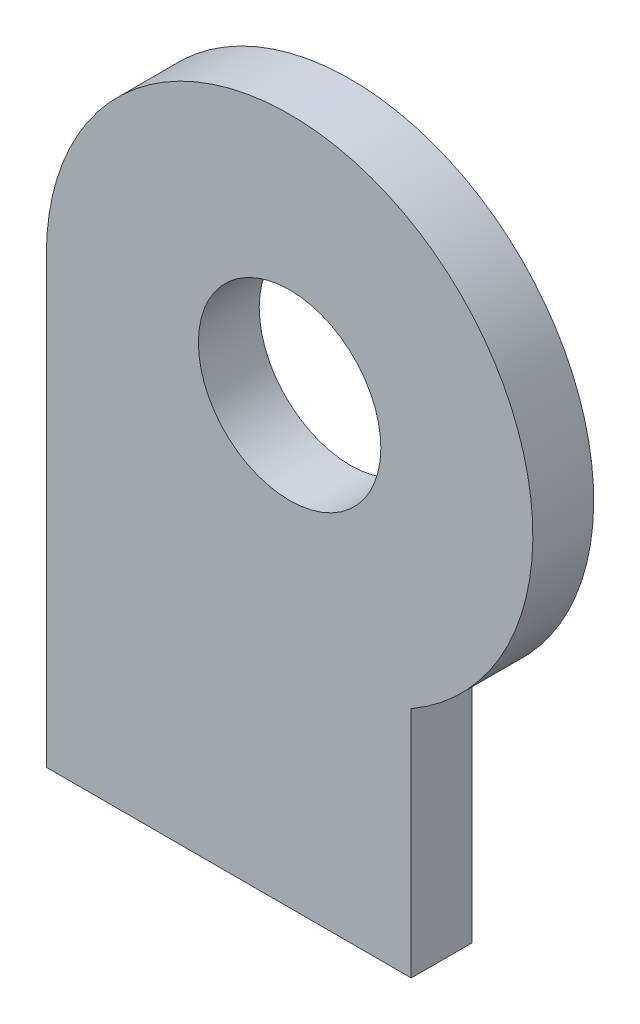
ISO-10303-21;
HEADER;
FILE_DESCRIPTION(('STEP AP214'),'2;1');
FILE_NAME('part.step','',(''),(''),'','','');
FILE_SCHEMA(('AUTOMOTIVE_DESIGN { 1 0 10303 214 1 1 1 1 }'));
ENDSEC;
DATA;
#1=APPLICATION_CONTEXT('core data for automotive mechanical design processes');
#2=APPLICATION_PROTOCOL_DEFINITION('international standard','automotive_design',2000,#1);
#3=PRODUCT_CONTEXT('',#1,'mechanical');
#4=PRODUCT('Part','Part','',(#3));
#5=PRODUCT_RELATED_PRODUCT_CATEGORY('part','',(#4));
#6=PRODUCT_DEFINITION_FORMATION('','',#4);
#7=PRODUCT_DEFINITION_CONTEXT('part definition',#1,'design');
#8=PRODUCT_DEFINITION('design','',#6,#7);
#9=PRODUCT_DEFINITION_SHAPE('','',#8);
#10=(LENGTH_UNIT() NAMED_UNIT(*) SI_UNIT(.MILLI.,.METRE.));
#11=(NAMED_UNIT(*) PLANE_ANGLE_UNIT() SI_UNIT($,.RADIAN.));
#12=(NAMED_UNIT(*) SI_UNIT($,.STERADIAN.) SOLID_ANGLE_UNIT());
#13=UNCERTAINTY_MEASURE_WITH_UNIT(LENGTH_MEASURE(1.E-05),#10,'distance_accuracy_value','');
#14=(GEOMETRIC_REPRESENTATION_CONTEXT(3) GLOBAL_UNCERTAINTY_ASSIGNED_CONTEXT((#13)) GLOBAL_UNIT_ASSIGNED_CONTEXT((#10,
#11,#12)) REPRESENTATION_CONTEXT('',''));
#15=CARTESIAN_POINT('',(0.,0.,0.));
#16=DIRECTION('',(0.,0.,1.));
#17=DIRECTION('',(1.,0.,0.));
#18=AXIS2_PLACEMENT_3D('',#15,#16,#17);
#19=CARTESIAN_POINT('',(20.6876756424581,20.35683,3.175));
#20=DIRECTION('',(0.,0.,1.));
#21=DIRECTION('',(1.,0.,0.));
#22=AXIS2_PLACEMENT_3D('',#19,#20,#21);
#23=PLANE('',#22);
#24=DIRECTION('',(0.,1.,0.));
#25=VECTOR('',#24,1.);
#26=CARTESIAN_POINT('',(27.0376756424581,-2.82067,3.175));
#27=LINE('',#26,#25);
#28=CARTESIAN_POINT('',(27.0376756424581,-2.82067,3.175));
#29=VERTEX_POINT('',#28);
#30=CARTESIAN_POINT('',(27.0376756424581,9.35830737193762,3.175));
#31=VERTEX_POINT('',#30);
#32=EDGE_CURVE('E96',#29,#31,#27,.T.);
#33=ORIENTED_EDGE('',*,*,#32,.T.);
#34=CARTESIAN_POINT('',(20.6876756424581,20.35683,3.175));
#35=DIRECTION('',(0.,0.,1.));
#36=DIRECTION('',(1.,0.,0.));
#37=AXIS2_PLACEMENT_3D('',#34,#35,#36);
#38=CIRCLE('',#37,12.7);
#39=CARTESIAN_POINT('',(7.98767564245811,20.35683,3.175));
#40=VERTEX_POINT('',#39);
#41=EDGE_CURVE('E91',#31,#40,#38,.T.);
#42=ORIENTED_EDGE('',*,*,#41,.T.);
#43=DIRECTION('',(0.,-1.,0.));
#44=VECTOR('',#43,1.);
#45=CARTESIAN_POINT('',(7.98767564245811,20.35683,3.175));
#46=LINE('',#45,#44);
#47=CARTESIAN_POINT('',(7.9876756424581,-2.82067,3.175));
#48=VERTEX_POINT('',#47);
#49=EDGE_CURVE('E94',#40,#48,#46,.T.);
#50=ORIENTED_EDGE('',*,*,#49,.T.);
#51=DIRECTION('',(1.,0.,0.));
#52=VECTOR('',#51,1.);
#53=CARTESIAN_POINT('',(7.9876756424581,-2.82067,3.175));
#54=LINE('',#53,#52);
#55=EDGE_CURVE('E61',#48,#29,#54,.T.);
#56=ORIENTED_EDGE('',*,*,#55,.T.);
#57=EDGE_LOOP('',(#33,#42,#50,#56));
#58=FACE_BOUND('',#57,.T.);
#59=CARTESIAN_POINT('',(20.6876756424581,20.35683,3.175));
#60=DIRECTION('',(0.,0.,1.));
#61=DIRECTION('',(1.,0.,0.));
#62=AXIS2_PLACEMENT_3D('',#59,#60,#61);
#63=CIRCLE('',#62,4.7625);
#64=CARTESIAN_POINT('',(25.4501756424581,20.35683,3.175));
#65=VERTEX_POINT('',#64);
#66=EDGE_CURVE('E116',#65,#65,#63,.T.);
#67=ORIENTED_EDGE('',*,*,#66,.F.);
#68=EDGE_LOOP('',(#67));
#69=FACE_BOUND('',#68,.T.);
#70=ADVANCED_FACE('F43',(#58,#69),#23,.T.);
#71=CARTESIAN_POINT('',(20.6876756424581,20.35683,0.));
#72=DIRECTION('',(0.,0.,1.));
#73=DIRECTION('',(1.,0.,0.));
#74=AXIS2_PLACEMENT_3D('',#71,#72,#73);
#75=PLANE('',#74);
#76=DIRECTION('',(0.,1.,0.));
#77=VECTOR('',#76,1.);
#78=CARTESIAN_POINT('',(27.0376756424581,-2.82067,0.));
#79=LINE('',#78,#77);
#80=CARTESIAN_POINT('',(27.0376756424581,-2.82067,0.));
#81=VERTEX_POINT('',#80);
#82=CARTESIAN_POINT('',(27.0376756424581,9.35830737193762,0.));
#83=VERTEX_POINT('',#82);
#84=EDGE_CURVE('E112',#81,#83,#79,.T.);
#85=ORIENTED_EDGE('',*,*,#84,.F.);
#86=DIRECTION('',(1.,0.,0.));
#87=VECTOR('',#86,1.);
#88=CARTESIAN_POINT('',(7.9876756424581,-2.82067,0.));
#89=LINE('',#88,#87);
#90=CARTESIAN_POINT('',(7.9876756424581,-2.82067,0.));
#91=VERTEX_POINT('',#90);
#92=EDGE_CURVE('E84',#91,#81,#89,.T.);
#93=ORIENTED_EDGE('',*,*,#92,.F.);
#94=DIRECTION('',(0.,-1.,0.));
#95=VECTOR('',#94,1.);
#96=CARTESIAN_POINT('',(7.98767564245811,20.35683,0.));
#97=LINE('',#96,#95);
#98=CARTESIAN_POINT('',(7.98767564245811,20.35683,0.));
#99=VERTEX_POINT('',#98);
#100=EDGE_CURVE('E78',#99,#91,#97,.T.);
#101=ORIENTED_EDGE('',*,*,#100,.F.);
#102=CARTESIAN_POINT('',(20.6876756424581,20.35683,0.));
#103=DIRECTION('',(0.,0.,1.));
#104=DIRECTION('',(1.,0.,0.));
#105=AXIS2_PLACEMENT_3D('',#102,#103,#104);
#106=CIRCLE('',#105,12.7);
#107=EDGE_CURVE('E101',#83,#99,#106,.T.);
#108=ORIENTED_EDGE('',*,*,#107,.F.);
#109=EDGE_LOOP('',(#85,#93,#101,#108));
#110=FACE_BOUND('',#109,.T.);
#111=CARTESIAN_POINT('',(20.6876756424581,20.35683,0.));
#112=DIRECTION('',(0.,0.,1.));
#113=DIRECTION('',(1.,0.,0.));
#114=AXIS2_PLACEMENT_3D('',#111,#112,#113);
#115=CIRCLE('',#114,4.7625);
#116=CARTESIAN_POINT('',(25.4501756424581,20.35683,0.));
#117=VERTEX_POINT('',#116);
#118=EDGE_CURVE('E134',#117,#117,#115,.T.);
#119=ORIENTED_EDGE('',*,*,#118,.T.);
#120=EDGE_LOOP('',(#119));
#121=FACE_BOUND('',#120,.T.);
#122=ADVANCED_FACE('F129',(#110,#121),#75,.F.);
#123=CARTESIAN_POINT('',(27.0376756424581,-2.82067,3.175));
#124=DIRECTION('',(-1.,0.,0.));
#125=DIRECTION('',(0.,0.,1.));
#126=AXIS2_PLACEMENT_3D('',#123,#124,#125);
#127=PLANE('',#126);
#128=ORIENTED_EDGE('',*,*,#84,.T.);
#129=DIRECTION('',(0.,0.,-1.));
#130=VECTOR('',#129,1.);
#131=CARTESIAN_POINT('',(27.0376756424581,9.35830737193762,3.175));
#132=LINE('',#131,#130);
#133=EDGE_CURVE('E11',#31,#83,#132,.T.);
#134=ORIENTED_EDGE('',*,*,#133,.F.);
#135=ORIENTED_EDGE('',*,*,#32,.F.);
#136=DIRECTION('',(0.,0.,-1.));
#137=VECTOR('',#136,1.);
#138=CARTESIAN_POINT('',(27.0376756424581,-2.82067,3.175));
#139=LINE('',#138,#137);
#140=EDGE_CURVE('E108',#29,#81,#139,.T.);
#141=ORIENTED_EDGE('',*,*,#140,.T.);
#142=EDGE_LOOP('',(#128,#134,#135,#141));
#143=FACE_BOUND('',#142,.T.);
#144=ADVANCED_FACE('F45',(#143),#127,.F.);
#145=CARTESIAN_POINT('',(20.6876756424581,20.35683,3.175));
#146=DIRECTION('',(0.,0.,-1.));
#147=DIRECTION('',(-1.,0.,0.));
#148=AXIS2_PLACEMENT_3D('',#145,#146,#147);
#149=CYLINDRICAL_SURFACE('',#148,12.7);
#150=ORIENTED_EDGE('',*,*,#107,.T.);
#151=DIRECTION('',(0.,0.,-1.));
#152=VECTOR('',#151,1.);
#153=CARTESIAN_POINT('',(7.98767564245811,20.35683,3.175));
#154=LINE('',#153,#152);
#155=EDGE_CURVE('E53',#40,#99,#154,.T.);
#156=ORIENTED_EDGE('',*,*,#155,.F.);
#157=ORIENTED_EDGE('',*,*,#41,.F.);
#158=ORIENTED_EDGE('',*,*,#133,.T.);
#159=EDGE_LOOP('',(#150,#156,#157,#158));
#160=FACE_BOUND('',#159,.T.);
#161=ADVANCED_FACE('F100',(#160),#149,.T.);
#162=CARTESIAN_POINT('',(7.98767564245811,20.35683,3.175));
#163=DIRECTION('',(1.,0.,0.));
#164=DIRECTION('',(0.,1.,0.));
#165=AXIS2_PLACEMENT_3D('',#162,#163,#164);
#166=PLANE('',#165);
#167=ORIENTED_EDGE('',*,*,#100,.T.);
#168=DIRECTION('',(0.,0.,-1.));
#169=VECTOR('',#168,1.);
#170=CARTESIAN_POINT('',(7.9876756424581,-2.82067,3.175));
#171=LINE('',#170,#169);
#172=EDGE_CURVE('E103',#48,#91,#171,.T.);
#173=ORIENTED_EDGE('',*,*,#172,.F.);
#174=ORIENTED_EDGE('',*,*,#49,.F.);
#175=ORIENTED_EDGE('',*,*,#155,.T.);
#176=EDGE_LOOP('',(#167,#173,#174,#175));
#177=FACE_BOUND('',#176,.T.);
#178=ADVANCED_FACE('F104',(#177),#166,.F.);
#179=CARTESIAN_POINT('',(7.9876756424581,-2.82067,3.175));
#180=DIRECTION('',(0.,1.,0.));
#181=DIRECTION('',(0.,0.,1.));
#182=AXIS2_PLACEMENT_3D('',#179,#180,#181);
#183=PLANE('',#182);
#184=ORIENTED_EDGE('',*,*,#92,.T.);
#185=ORIENTED_EDGE('',*,*,#140,.F.);
#186=ORIENTED_EDGE('',*,*,#55,.F.);
#187=ORIENTED_EDGE('',*,*,#172,.T.);
#188=EDGE_LOOP('',(#184,#185,#186,#187));
#189=FACE_BOUND('',#188,.T.);
#190=ADVANCED_FACE('F126',(#189),#183,.F.);
#191=CARTESIAN_POINT('',(20.6876756424581,20.35683,3.175));
#192=DIRECTION('',(0.,0.,-1.));
#193=DIRECTION('',(-1.,0.,0.));
#194=AXIS2_PLACEMENT_3D('',#191,#192,#193);
#195=CYLINDRICAL_SURFACE('',#194,4.7625);
#196=ORIENTED_EDGE('',*,*,#66,.T.);
#197=EDGE_LOOP('',(#196));
#198=FACE_BOUND('',#197,.T.);
#199=ORIENTED_EDGE('',*,*,#118,.F.);
#200=EDGE_LOOP('',(#199));
#201=FACE_BOUND('',#200,.T.);
#202=ADVANCED_FACE('F142',(#198,#201),#195,.F.);
#203=CLOSED_SHELL('',(#70,#122,#144,#161,#178,#190,#202));
#204=MANIFOLD_SOLID_BREP('B2',#203);
#205=ADVANCED_BREP_SHAPE_REPRESENTATION('',(#18,#204),#14);
#206=SHAPE_DEFINITION_REPRESENTATION(#9,#205);
ENDSEC;
END-ISO-10303-21;
